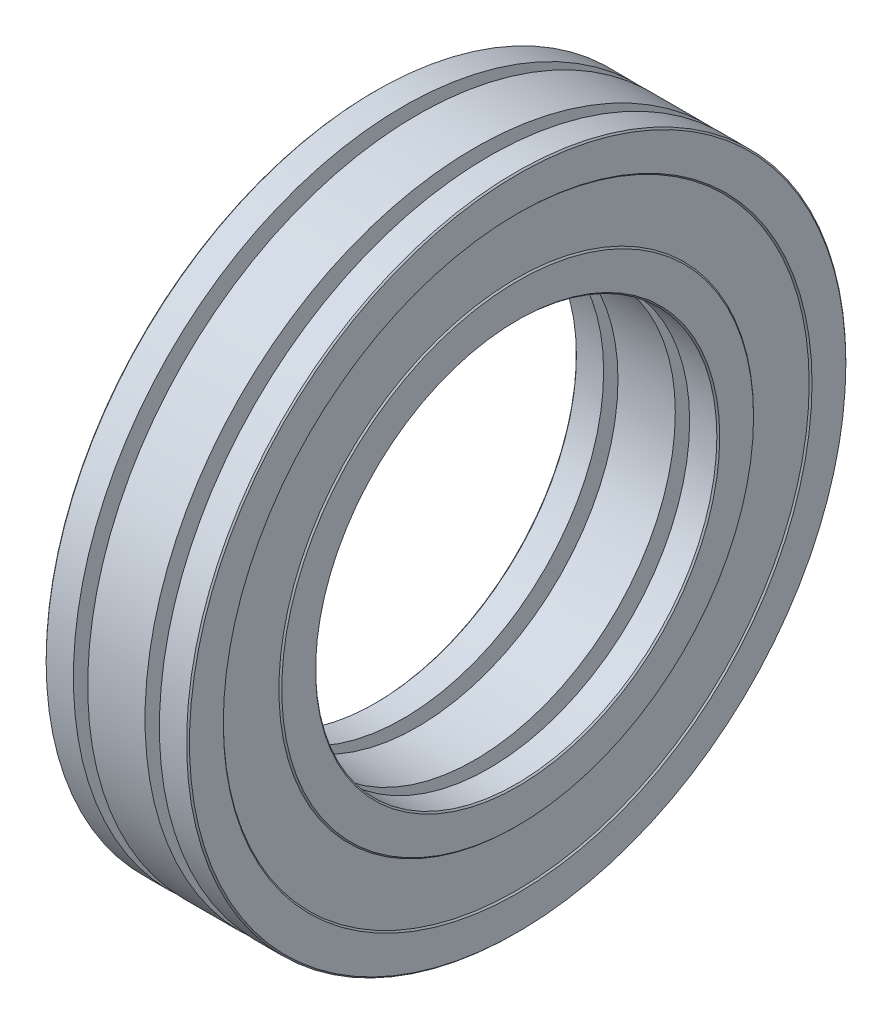
ISO-10303-21;
HEADER;
FILE_DESCRIPTION(('STEP AP214'),'2;1');
FILE_NAME('part.step','',(''),(''),'','','');
FILE_SCHEMA(('AUTOMOTIVE_DESIGN { 1 0 10303 214 1 1 1 1 }'));
ENDSEC;
DATA;
#1=APPLICATION_CONTEXT('core data for automotive mechanical design processes');
#2=APPLICATION_PROTOCOL_DEFINITION('international standard','automotive_design',2000,#1);
#3=PRODUCT_CONTEXT('',#1,'mechanical');
#4=PRODUCT('Part','Part','',(#3));
#5=PRODUCT_RELATED_PRODUCT_CATEGORY('part','',(#4));
#6=PRODUCT_DEFINITION_FORMATION('','',#4);
#7=PRODUCT_DEFINITION_CONTEXT('part definition',#1,'design');
#8=PRODUCT_DEFINITION('design','',#6,#7);
#9=PRODUCT_DEFINITION_SHAPE('','',#8);
#10=(LENGTH_UNIT() NAMED_UNIT(*) SI_UNIT(.MILLI.,.METRE.));
#11=(NAMED_UNIT(*) PLANE_ANGLE_UNIT() SI_UNIT($,.RADIAN.));
#12=(NAMED_UNIT(*) SI_UNIT($,.STERADIAN.) SOLID_ANGLE_UNIT());
#13=UNCERTAINTY_MEASURE_WITH_UNIT(LENGTH_MEASURE(1.E-05),#10,'distance_accuracy_value','');
#14=(GEOMETRIC_REPRESENTATION_CONTEXT(3) GLOBAL_UNCERTAINTY_ASSIGNED_CONTEXT((#13)) GLOBAL_UNIT_ASSIGNED_CONTEXT((#10,
#11,#12)) REPRESENTATION_CONTEXT('',''));
#15=CARTESIAN_POINT('',(0.,0.,0.));
#16=DIRECTION('',(0.,0.,1.));
#17=DIRECTION('',(1.,0.,0.));
#18=AXIS2_PLACEMENT_3D('',#15,#16,#17);
#19=CARTESIAN_POINT('',(0.935183111350298,8.2801724137931,0.));
#20=DIRECTION('',(-1.,0.,0.));
#21=DIRECTION('',(0.,0.,1.));
#22=AXIS2_PLACEMENT_3D('',#19,#20,#21);
#23=PLANE('',#22);
#24=CARTESIAN_POINT('',(0.935183111350298,0.,0.));
#25=DIRECTION('',(-1.,0.,0.));
#26=DIRECTION('',(0.,0.,1.));
#27=AXIS2_PLACEMENT_3D('',#24,#25,#26);
#28=CIRCLE('',#27,8.2301724137931);
#29=CARTESIAN_POINT('',(0.935183111350298,0.,8.2301724137931));
#30=VERTEX_POINT('',#29);
#31=EDGE_CURVE('E83',#30,#30,#28,.T.);
#32=ORIENTED_EDGE('',*,*,#31,.T.);
#33=EDGE_LOOP('',(#32));
#34=FACE_BOUND('',#33,.T.);
#35=CARTESIAN_POINT('',(0.935183111350298,0.,0.));
#36=DIRECTION('',(-1.,0.,0.));
#37=DIRECTION('',(0.,0.,1.));
#38=AXIS2_PLACEMENT_3D('',#35,#36,#37);
#39=CIRCLE('',#38,7.05);
#40=CARTESIAN_POINT('',(0.935183111350298,0.,7.05));
#41=VERTEX_POINT('',#40);
#42=EDGE_CURVE('E86',#41,#41,#39,.F.);
#43=ORIENTED_EDGE('',*,*,#42,.T.);
#44=EDGE_LOOP('',(#43));
#45=FACE_BOUND('',#44,.T.);
#46=ADVANCED_FACE('F45',(#34,#45),#23,.T.);
#47=CARTESIAN_POINT('',(0.,0.,0.));
#48=DIRECTION('',(1.,0.,0.));
#49=DIRECTION('',(0.,0.,-1.));
#50=AXIS2_PLACEMENT_3D('',#47,#48,#49);
#51=CYLINDRICAL_SURFACE('',#50,7.);
#52=CARTESIAN_POINT('',(0.985183111350298,0.,0.));
#53=DIRECTION('',(-1.,0.,0.));
#54=DIRECTION('',(0.,0.,1.));
#55=AXIS2_PLACEMENT_3D('',#52,#53,#54);
#56=CIRCLE('',#55,7.);
#57=CARTESIAN_POINT('',(0.985183111350298,0.,7.));
#58=VERTEX_POINT('',#57);
#59=EDGE_CURVE('E80',#58,#58,#56,.T.);
#60=ORIENTED_EDGE('',*,*,#59,.T.);
#61=EDGE_LOOP('',(#60));
#62=FACE_BOUND('',#61,.T.);
#63=CARTESIAN_POINT('',(1.9351831113503,0.,0.));
#64=DIRECTION('',(1.,0.,0.));
#65=DIRECTION('',(0.,0.,-1.));
#66=AXIS2_PLACEMENT_3D('',#63,#64,#65);
#67=CIRCLE('',#66,7.);
#68=CARTESIAN_POINT('',(1.9351831113503,0.,-7.));
#69=VERTEX_POINT('',#68);
#70=EDGE_CURVE('E89',#69,#69,#67,.T.);
#71=ORIENTED_EDGE('',*,*,#70,.T.);
#72=EDGE_LOOP('',(#71));
#73=FACE_BOUND('',#72,.T.);
#74=ADVANCED_FACE('F170',(#62,#73),#51,.F.);
#75=CARTESIAN_POINT('',(1.9351831113503,7.,0.));
#76=DIRECTION('',(1.,0.,0.));
#77=DIRECTION('',(0.,0.,-1.));
#78=AXIS2_PLACEMENT_3D('',#75,#76,#77);
#79=PLANE('',#78);
#80=CARTESIAN_POINT('',(1.9351831113503,0.,0.));
#81=DIRECTION('',(1.,0.,0.));
#82=DIRECTION('',(0.,0.,-1.));
#83=AXIS2_PLACEMENT_3D('',#80,#81,#82);
#84=CIRCLE('',#83,7.8);
#85=CARTESIAN_POINT('',(1.9351831113503,0.,-7.8));
#86=VERTEX_POINT('',#85);
#87=EDGE_CURVE('E92',#86,#86,#84,.T.);
#88=ORIENTED_EDGE('',*,*,#87,.T.);
#89=EDGE_LOOP('',(#88));
#90=FACE_BOUND('',#89,.T.);
#91=ORIENTED_EDGE('',*,*,#70,.F.);
#92=EDGE_LOOP('',(#91));
#93=FACE_BOUND('',#92,.T.);
#94=ADVANCED_FACE('F175',(#90,#93),#79,.T.);
#95=CARTESIAN_POINT('',(0.,0.,0.));
#96=DIRECTION('',(1.,0.,0.));
#97=DIRECTION('',(0.,0.,-1.));
#98=AXIS2_PLACEMENT_3D('',#95,#96,#97);
#99=CYLINDRICAL_SURFACE('',#98,7.8);
#100=CARTESIAN_POINT('',(2.4351831113503,0.,0.));
#101=DIRECTION('',(1.,0.,0.));
#102=DIRECTION('',(0.,0.,-1.));
#103=AXIS2_PLACEMENT_3D('',#100,#101,#102);
#104=CIRCLE('',#103,7.8);
#105=CARTESIAN_POINT('',(2.4351831113503,0.,-7.8));
#106=VERTEX_POINT('',#105);
#107=EDGE_CURVE('E95',#106,#106,#104,.T.);
#108=ORIENTED_EDGE('',*,*,#107,.T.);
#109=EDGE_LOOP('',(#108));
#110=FACE_BOUND('',#109,.T.);
#111=ORIENTED_EDGE('',*,*,#87,.F.);
#112=EDGE_LOOP('',(#111));
#113=FACE_BOUND('',#112,.T.);
#114=ADVANCED_FACE('F182',(#110,#113),#99,.F.);
#115=CARTESIAN_POINT('',(2.4351831113503,7.8,0.));
#116=DIRECTION('',(-1.,0.,0.));
#117=DIRECTION('',(0.,0.,1.));
#118=AXIS2_PLACEMENT_3D('',#115,#116,#117);
#119=PLANE('',#118);
#120=CARTESIAN_POINT('',(2.4351831113503,0.,0.));
#121=DIRECTION('',(1.,0.,0.));
#122=DIRECTION('',(0.,0.,-1.));
#123=AXIS2_PLACEMENT_3D('',#120,#121,#122);
#124=CIRCLE('',#123,7.);
#125=CARTESIAN_POINT('',(2.4351831113503,0.,-7.));
#126=VERTEX_POINT('',#125);
#127=EDGE_CURVE('E98',#126,#126,#124,.T.);
#128=ORIENTED_EDGE('',*,*,#127,.T.);
#129=EDGE_LOOP('',(#128));
#130=FACE_BOUND('',#129,.T.);
#131=ORIENTED_EDGE('',*,*,#107,.F.);
#132=EDGE_LOOP('',(#131));
#133=FACE_BOUND('',#132,.T.);
#134=ADVANCED_FACE('F186',(#130,#133),#119,.T.);
#135=CARTESIAN_POINT('',(0.,0.,0.));
#136=DIRECTION('',(1.,0.,0.));
#137=DIRECTION('',(0.,0.,-1.));
#138=AXIS2_PLACEMENT_3D('',#135,#136,#137);
#139=CYLINDRICAL_SURFACE('',#138,7.);
#140=CARTESIAN_POINT('',(4.4351831113503,0.,0.));
#141=DIRECTION('',(1.,0.,0.));
#142=DIRECTION('',(0.,0.,-1.));
#143=AXIS2_PLACEMENT_3D('',#140,#141,#142);
#144=CIRCLE('',#143,7.);
#145=CARTESIAN_POINT('',(4.4351831113503,0.,-7.));
#146=VERTEX_POINT('',#145);
#147=EDGE_CURVE('E101',#146,#146,#144,.T.);
#148=ORIENTED_EDGE('',*,*,#147,.T.);
#149=EDGE_LOOP('',(#148));
#150=FACE_BOUND('',#149,.T.);
#151=ORIENTED_EDGE('',*,*,#127,.F.);
#152=EDGE_LOOP('',(#151));
#153=FACE_BOUND('',#152,.T.);
#154=ADVANCED_FACE('F190',(#150,#153),#139,.F.);
#155=CARTESIAN_POINT('',(4.4351831113503,7.,0.));
#156=DIRECTION('',(1.,0.,0.));
#157=DIRECTION('',(0.,0.,-1.));
#158=AXIS2_PLACEMENT_3D('',#155,#156,#157);
#159=PLANE('',#158);
#160=CARTESIAN_POINT('',(4.4351831113503,0.,0.));
#161=DIRECTION('',(1.,0.,0.));
#162=DIRECTION('',(0.,0.,-1.));
#163=AXIS2_PLACEMENT_3D('',#160,#161,#162);
#164=CIRCLE('',#163,7.8);
#165=CARTESIAN_POINT('',(4.4351831113503,0.,-7.8));
#166=VERTEX_POINT('',#165);
#167=EDGE_CURVE('E104',#166,#166,#164,.T.);
#168=ORIENTED_EDGE('',*,*,#167,.T.);
#169=EDGE_LOOP('',(#168));
#170=FACE_BOUND('',#169,.T.);
#171=ORIENTED_EDGE('',*,*,#147,.F.);
#172=EDGE_LOOP('',(#171));
#173=FACE_BOUND('',#172,.T.);
#174=ADVANCED_FACE('F194',(#170,#173),#159,.T.);
#175=CARTESIAN_POINT('',(0.,0.,0.));
#176=DIRECTION('',(1.,0.,0.));
#177=DIRECTION('',(0.,0.,-1.));
#178=AXIS2_PLACEMENT_3D('',#175,#176,#177);
#179=CYLINDRICAL_SURFACE('',#178,7.8);
#180=CARTESIAN_POINT('',(4.9351831113503,0.,0.));
#181=DIRECTION('',(1.,0.,0.));
#182=DIRECTION('',(0.,0.,-1.));
#183=AXIS2_PLACEMENT_3D('',#180,#181,#182);
#184=CIRCLE('',#183,7.8);
#185=CARTESIAN_POINT('',(4.9351831113503,0.,-7.8));
#186=VERTEX_POINT('',#185);
#187=EDGE_CURVE('E107',#186,#186,#184,.T.);
#188=ORIENTED_EDGE('',*,*,#187,.T.);
#189=EDGE_LOOP('',(#188));
#190=FACE_BOUND('',#189,.T.);
#191=ORIENTED_EDGE('',*,*,#167,.F.);
#192=EDGE_LOOP('',(#191));
#193=FACE_BOUND('',#192,.T.);
#194=ADVANCED_FACE('F198',(#190,#193),#179,.F.);
#195=CARTESIAN_POINT('',(4.9351831113503,7.8,0.));
#196=DIRECTION('',(-1.,0.,0.));
#197=DIRECTION('',(0.,0.,1.));
#198=AXIS2_PLACEMENT_3D('',#195,#196,#197);
#199=PLANE('',#198);
#200=CARTESIAN_POINT('',(4.9351831113503,0.,0.));
#201=DIRECTION('',(1.,0.,0.));
#202=DIRECTION('',(0.,0.,-1.));
#203=AXIS2_PLACEMENT_3D('',#200,#201,#202);
#204=CIRCLE('',#203,7.);
#205=CARTESIAN_POINT('',(4.9351831113503,0.,-7.));
#206=VERTEX_POINT('',#205);
#207=EDGE_CURVE('E110',#206,#206,#204,.T.);
#208=ORIENTED_EDGE('',*,*,#207,.T.);
#209=EDGE_LOOP('',(#208));
#210=FACE_BOUND('',#209,.T.);
#211=ORIENTED_EDGE('',*,*,#187,.F.);
#212=EDGE_LOOP('',(#211));
#213=FACE_BOUND('',#212,.T.);
#214=ADVANCED_FACE('F202',(#210,#213),#199,.T.);
#215=CARTESIAN_POINT('',(0.,0.,0.));
#216=DIRECTION('',(1.,0.,0.));
#217=DIRECTION('',(0.,0.,-1.));
#218=AXIS2_PLACEMENT_3D('',#215,#216,#217);
#219=CYLINDRICAL_SURFACE('',#218,7.);
#220=CARTESIAN_POINT('',(5.8851831113503,0.,0.));
#221=DIRECTION('',(1.,0.,0.));
#222=DIRECTION('',(0.,0.,-1.));
#223=AXIS2_PLACEMENT_3D('',#220,#221,#222);
#224=CIRCLE('',#223,7.);
#225=CARTESIAN_POINT('',(5.8851831113503,0.,-7.));
#226=VERTEX_POINT('',#225);
#227=EDGE_CURVE('E68',#226,#226,#224,.T.);
#228=ORIENTED_EDGE('',*,*,#227,.T.);
#229=EDGE_LOOP('',(#228));
#230=FACE_BOUND('',#229,.T.);
#231=ORIENTED_EDGE('',*,*,#207,.F.);
#232=EDGE_LOOP('',(#231));
#233=FACE_BOUND('',#232,.T.);
#234=ADVANCED_FACE('F206',(#230,#233),#219,.F.);
#235=CARTESIAN_POINT('',(5.9351831113503,7.,0.));
#236=DIRECTION('',(1.,0.,0.));
#237=DIRECTION('',(0.,0.,-1.));
#238=AXIS2_PLACEMENT_3D('',#235,#236,#237);
#239=PLANE('',#238);
#240=CARTESIAN_POINT('',(5.9351831113503,0.,0.));
#241=DIRECTION('',(1.,0.,0.));
#242=DIRECTION('',(0.,0.,-1.));
#243=AXIS2_PLACEMENT_3D('',#240,#241,#242);
#244=CIRCLE('',#243,7.05);
#245=CARTESIAN_POINT('',(5.9351831113503,0.,-7.05));
#246=VERTEX_POINT('',#245);
#247=EDGE_CURVE('E60',#246,#246,#244,.F.);
#248=ORIENTED_EDGE('',*,*,#247,.T.);
#249=EDGE_LOOP('',(#248));
#250=FACE_BOUND('',#249,.T.);
#251=CARTESIAN_POINT('',(5.9351831113503,0.,0.));
#252=DIRECTION('',(1.,0.,0.));
#253=DIRECTION('',(0.,0.,-1.));
#254=AXIS2_PLACEMENT_3D('',#251,#252,#253);
#255=CIRCLE('',#254,8.2301724137931);
#256=CARTESIAN_POINT('',(5.9351831113503,0.,-8.2301724137931));
#257=VERTEX_POINT('',#256);
#258=EDGE_CURVE('E65',#257,#257,#255,.T.);
#259=ORIENTED_EDGE('',*,*,#258,.T.);
#260=EDGE_LOOP('',(#259));
#261=FACE_BOUND('',#260,.T.);
#262=ADVANCED_FACE('F210',(#250,#261),#239,.T.);
#263=CARTESIAN_POINT('',(5.8851831113503,8.2801724137931,0.));
#264=DIRECTION('',(1.,0.,0.));
#265=DIRECTION('',(0.,0.,-1.));
#266=AXIS2_PLACEMENT_3D('',#263,#264,#265);
#267=PLANE('',#266);
#268=CARTESIAN_POINT('',(5.8851831113503,0.,0.));
#269=DIRECTION('',(1.,0.,0.));
#270=DIRECTION('',(0.,0.,-1.));
#271=AXIS2_PLACEMENT_3D('',#268,#269,#270);
#272=CIRCLE('',#271,10.2198275862069);
#273=CARTESIAN_POINT('',(5.8851831113503,0.,-10.2198275862069));
#274=VERTEX_POINT('',#273);
#275=EDGE_CURVE('E116',#274,#274,#272,.T.);
#276=ORIENTED_EDGE('',*,*,#275,.T.);
#277=EDGE_LOOP('',(#276));
#278=FACE_BOUND('',#277,.T.);
#279=CARTESIAN_POINT('',(5.8851831113503,0.,0.));
#280=DIRECTION('',(1.,0.,0.));
#281=DIRECTION('',(0.,0.,-1.));
#282=AXIS2_PLACEMENT_3D('',#279,#280,#281);
#283=CIRCLE('',#282,8.2801724137931);
#284=CARTESIAN_POINT('',(5.8851831113503,0.,-8.2801724137931));
#285=VERTEX_POINT('',#284);
#286=EDGE_CURVE('E113',#285,#285,#283,.T.);
#287=ORIENTED_EDGE('',*,*,#286,.F.);
#288=EDGE_LOOP('',(#287));
#289=FACE_BOUND('',#288,.T.);
#290=ADVANCED_FACE('F214',(#278,#289),#267,.T.);
#291=CARTESIAN_POINT('',(5.9351831113503,10.2198275862069,0.));
#292=DIRECTION('',(1.,0.,0.));
#293=DIRECTION('',(0.,0.,-1.));
#294=AXIS2_PLACEMENT_3D('',#291,#292,#293);
#295=PLANE('',#294);
#296=CARTESIAN_POINT('',(5.9351831113503,0.,0.));
#297=DIRECTION('',(1.,0.,0.));
#298=DIRECTION('',(0.,0.,-1.));
#299=AXIS2_PLACEMENT_3D('',#296,#297,#298);
#300=CIRCLE('',#299,10.2698275862069);
#301=CARTESIAN_POINT('',(5.9351831113503,0.,-10.2698275862069));
#302=VERTEX_POINT('',#301);
#303=EDGE_CURVE('E52',#302,#302,#300,.F.);
#304=ORIENTED_EDGE('',*,*,#303,.T.);
#305=EDGE_LOOP('',(#304));
#306=FACE_BOUND('',#305,.T.);
#307=CARTESIAN_POINT('',(5.9351831113503,0.,0.));
#308=DIRECTION('',(1.,0.,0.));
#309=DIRECTION('',(0.,0.,-1.));
#310=AXIS2_PLACEMENT_3D('',#307,#308,#309);
#311=CIRCLE('',#310,11.45);
#312=CARTESIAN_POINT('',(5.9351831113503,0.,-11.45));
#313=VERTEX_POINT('',#312);
#314=EDGE_CURVE('E56',#313,#313,#311,.T.);
#315=ORIENTED_EDGE('',*,*,#314,.T.);
#316=EDGE_LOOP('',(#315));
#317=FACE_BOUND('',#316,.T.);
#318=ADVANCED_FACE('F218',(#306,#317),#295,.T.);
#319=CARTESIAN_POINT('',(0.,0.,0.));
#320=DIRECTION('',(1.,0.,0.));
#321=DIRECTION('',(0.,0.,-1.));
#322=AXIS2_PLACEMENT_3D('',#319,#320,#321);
#323=CYLINDRICAL_SURFACE('',#322,11.5);
#324=CARTESIAN_POINT('',(5.8851831113503,0.,0.));
#325=DIRECTION('',(1.,0.,0.));
#326=DIRECTION('',(0.,0.,-1.));
#327=AXIS2_PLACEMENT_3D('',#324,#325,#326);
#328=CIRCLE('',#327,11.5);
#329=CARTESIAN_POINT('',(5.8851831113503,0.,-11.5));
#330=VERTEX_POINT('',#329);
#331=EDGE_CURVE('E12',#330,#330,#328,.F.);
#332=ORIENTED_EDGE('',*,*,#331,.T.);
#333=EDGE_LOOP('',(#332));
#334=FACE_BOUND('',#333,.T.);
#335=CARTESIAN_POINT('',(4.9351831113503,0.,0.));
#336=DIRECTION('',(1.,0.,0.));
#337=DIRECTION('',(0.,0.,-1.));
#338=AXIS2_PLACEMENT_3D('',#335,#336,#337);
#339=CIRCLE('',#338,11.5);
#340=CARTESIAN_POINT('',(4.9351831113503,0.,-11.5));
#341=VERTEX_POINT('',#340);
#342=EDGE_CURVE('E119',#341,#341,#339,.T.);
#343=ORIENTED_EDGE('',*,*,#342,.T.);
#344=EDGE_LOOP('',(#343));
#345=FACE_BOUND('',#344,.T.);
#346=ADVANCED_FACE('F222',(#334,#345),#323,.T.);
#347=CARTESIAN_POINT('',(4.9351831113503,10.7,0.));
#348=DIRECTION('',(-1.,0.,0.));
#349=DIRECTION('',(0.,0.,1.));
#350=AXIS2_PLACEMENT_3D('',#347,#348,#349);
#351=PLANE('',#350);
#352=CARTESIAN_POINT('',(4.9351831113503,0.,0.));
#353=DIRECTION('',(1.,0.,0.));
#354=DIRECTION('',(0.,0.,-1.));
#355=AXIS2_PLACEMENT_3D('',#352,#353,#354);
#356=CIRCLE('',#355,10.7);
#357=CARTESIAN_POINT('',(4.9351831113503,0.,-10.7));
#358=VERTEX_POINT('',#357);
#359=EDGE_CURVE('E122',#358,#358,#356,.T.);
#360=ORIENTED_EDGE('',*,*,#359,.T.);
#361=EDGE_LOOP('',(#360));
#362=FACE_BOUND('',#361,.T.);
#363=ORIENTED_EDGE('',*,*,#342,.F.);
#364=EDGE_LOOP('',(#363));
#365=FACE_BOUND('',#364,.T.);
#366=ADVANCED_FACE('F225',(#362,#365),#351,.T.);
#367=CARTESIAN_POINT('',(0.,0.,0.));
#368=DIRECTION('',(1.,0.,0.));
#369=DIRECTION('',(0.,0.,-1.));
#370=AXIS2_PLACEMENT_3D('',#367,#368,#369);
#371=CYLINDRICAL_SURFACE('',#370,10.7);
#372=CARTESIAN_POINT('',(4.4351831113503,0.,0.));
#373=DIRECTION('',(1.,0.,0.));
#374=DIRECTION('',(0.,0.,-1.));
#375=AXIS2_PLACEMENT_3D('',#372,#373,#374);
#376=CIRCLE('',#375,10.7);
#377=CARTESIAN_POINT('',(4.4351831113503,0.,-10.7));
#378=VERTEX_POINT('',#377);
#379=EDGE_CURVE('E125',#378,#378,#376,.T.);
#380=ORIENTED_EDGE('',*,*,#379,.T.);
#381=EDGE_LOOP('',(#380));
#382=FACE_BOUND('',#381,.T.);
#383=ORIENTED_EDGE('',*,*,#359,.F.);
#384=EDGE_LOOP('',(#383));
#385=FACE_BOUND('',#384,.T.);
#386=ADVANCED_FACE('F228',(#382,#385),#371,.T.);
#387=CARTESIAN_POINT('',(4.4351831113503,11.5,0.));
#388=DIRECTION('',(1.,0.,0.));
#389=DIRECTION('',(0.,0.,-1.));
#390=AXIS2_PLACEMENT_3D('',#387,#388,#389);
#391=PLANE('',#390);
#392=CARTESIAN_POINT('',(4.4351831113503,0.,0.));
#393=DIRECTION('',(1.,0.,0.));
#394=DIRECTION('',(0.,0.,-1.));
#395=AXIS2_PLACEMENT_3D('',#392,#393,#394);
#396=CIRCLE('',#395,11.5);
#397=CARTESIAN_POINT('',(4.4351831113503,0.,-11.5));
#398=VERTEX_POINT('',#397);
#399=EDGE_CURVE('E128',#398,#398,#396,.T.);
#400=ORIENTED_EDGE('',*,*,#399,.T.);
#401=EDGE_LOOP('',(#400));
#402=FACE_BOUND('',#401,.T.);
#403=ORIENTED_EDGE('',*,*,#379,.F.);
#404=EDGE_LOOP('',(#403));
#405=FACE_BOUND('',#404,.T.);
#406=ADVANCED_FACE('F232',(#402,#405),#391,.T.);
#407=CARTESIAN_POINT('',(0.,0.,0.));
#408=DIRECTION('',(1.,0.,0.));
#409=DIRECTION('',(0.,0.,-1.));
#410=AXIS2_PLACEMENT_3D('',#407,#408,#409);
#411=CYLINDRICAL_SURFACE('',#410,11.5);
#412=CARTESIAN_POINT('',(2.4351831113503,0.,0.));
#413=DIRECTION('',(1.,0.,0.));
#414=DIRECTION('',(0.,0.,-1.));
#415=AXIS2_PLACEMENT_3D('',#412,#413,#414);
#416=CIRCLE('',#415,11.5);
#417=CARTESIAN_POINT('',(2.4351831113503,0.,-11.5));
#418=VERTEX_POINT('',#417);
#419=EDGE_CURVE('E131',#418,#418,#416,.T.);
#420=ORIENTED_EDGE('',*,*,#419,.T.);
#421=EDGE_LOOP('',(#420));
#422=FACE_BOUND('',#421,.T.);
#423=ORIENTED_EDGE('',*,*,#399,.F.);
#424=EDGE_LOOP('',(#423));
#425=FACE_BOUND('',#424,.T.);
#426=ADVANCED_FACE('F236',(#422,#425),#411,.T.);
#427=CARTESIAN_POINT('',(2.4351831113503,10.7,0.));
#428=DIRECTION('',(-1.,0.,0.));
#429=DIRECTION('',(0.,0.,1.));
#430=AXIS2_PLACEMENT_3D('',#427,#428,#429);
#431=PLANE('',#430);
#432=CARTESIAN_POINT('',(2.4351831113503,0.,0.));
#433=DIRECTION('',(1.,0.,0.));
#434=DIRECTION('',(0.,0.,-1.));
#435=AXIS2_PLACEMENT_3D('',#432,#433,#434);
#436=CIRCLE('',#435,10.7);
#437=CARTESIAN_POINT('',(2.4351831113503,0.,-10.7));
#438=VERTEX_POINT('',#437);
#439=EDGE_CURVE('E134',#438,#438,#436,.T.);
#440=ORIENTED_EDGE('',*,*,#439,.T.);
#441=EDGE_LOOP('',(#440));
#442=FACE_BOUND('',#441,.T.);
#443=ORIENTED_EDGE('',*,*,#419,.F.);
#444=EDGE_LOOP('',(#443));
#445=FACE_BOUND('',#444,.T.);
#446=ADVANCED_FACE('F240',(#442,#445),#431,.T.);
#447=CARTESIAN_POINT('',(0.,0.,0.));
#448=DIRECTION('',(1.,0.,0.));
#449=DIRECTION('',(0.,0.,-1.));
#450=AXIS2_PLACEMENT_3D('',#447,#448,#449);
#451=CYLINDRICAL_SURFACE('',#450,10.7);
#452=CARTESIAN_POINT('',(1.9351831113503,0.,0.));
#453=DIRECTION('',(1.,0.,0.));
#454=DIRECTION('',(0.,0.,-1.));
#455=AXIS2_PLACEMENT_3D('',#452,#453,#454);
#456=CIRCLE('',#455,10.7);
#457=CARTESIAN_POINT('',(1.9351831113503,0.,-10.7));
#458=VERTEX_POINT('',#457);
#459=EDGE_CURVE('E137',#458,#458,#456,.T.);
#460=ORIENTED_EDGE('',*,*,#459,.T.);
#461=EDGE_LOOP('',(#460));
#462=FACE_BOUND('',#461,.T.);
#463=ORIENTED_EDGE('',*,*,#439,.F.);
#464=EDGE_LOOP('',(#463));
#465=FACE_BOUND('',#464,.T.);
#466=ADVANCED_FACE('F244',(#462,#465),#451,.T.);
#467=CARTESIAN_POINT('',(1.9351831113503,11.5,0.));
#468=DIRECTION('',(1.,0.,0.));
#469=DIRECTION('',(0.,0.,-1.));
#470=AXIS2_PLACEMENT_3D('',#467,#468,#469);
#471=PLANE('',#470);
#472=CARTESIAN_POINT('',(1.9351831113503,0.,0.));
#473=DIRECTION('',(1.,0.,0.));
#474=DIRECTION('',(0.,0.,-1.));
#475=AXIS2_PLACEMENT_3D('',#472,#473,#474);
#476=CIRCLE('',#475,11.5);
#477=CARTESIAN_POINT('',(1.9351831113503,0.,-11.5));
#478=VERTEX_POINT('',#477);
#479=EDGE_CURVE('E140',#478,#478,#476,.T.);
#480=ORIENTED_EDGE('',*,*,#479,.T.);
#481=EDGE_LOOP('',(#480));
#482=FACE_BOUND('',#481,.T.);
#483=ORIENTED_EDGE('',*,*,#459,.F.);
#484=EDGE_LOOP('',(#483));
#485=FACE_BOUND('',#484,.T.);
#486=ADVANCED_FACE('F248',(#482,#485),#471,.T.);
#487=CARTESIAN_POINT('',(0.,0.,0.));
#488=DIRECTION('',(1.,0.,0.));
#489=DIRECTION('',(0.,0.,-1.));
#490=AXIS2_PLACEMENT_3D('',#487,#488,#489);
#491=CYLINDRICAL_SURFACE('',#490,11.5);
#492=CARTESIAN_POINT('',(0.985183111350301,0.,0.));
#493=DIRECTION('',(-1.,0.,0.));
#494=DIRECTION('',(0.,0.,1.));
#495=AXIS2_PLACEMENT_3D('',#492,#493,#494);
#496=CIRCLE('',#495,11.5);
#497=CARTESIAN_POINT('',(0.985183111350301,0.,11.5));
#498=VERTEX_POINT('',#497);
#499=EDGE_CURVE('E77',#498,#498,#496,.F.);
#500=ORIENTED_EDGE('',*,*,#499,.T.);
#501=EDGE_LOOP('',(#500));
#502=FACE_BOUND('',#501,.T.);
#503=ORIENTED_EDGE('',*,*,#479,.F.);
#504=EDGE_LOOP('',(#503));
#505=FACE_BOUND('',#504,.T.);
#506=ADVANCED_FACE('F252',(#502,#505),#491,.T.);
#507=CARTESIAN_POINT('',(0.935183111350298,11.5,0.));
#508=DIRECTION('',(-1.,0.,0.));
#509=DIRECTION('',(0.,0.,1.));
#510=AXIS2_PLACEMENT_3D('',#507,#508,#509);
#511=PLANE('',#510);
#512=CARTESIAN_POINT('',(0.935183111350298,0.,0.));
#513=DIRECTION('',(-1.,0.,0.));
#514=DIRECTION('',(0.,0.,1.));
#515=AXIS2_PLACEMENT_3D('',#512,#513,#514);
#516=CIRCLE('',#515,11.45);
#517=CARTESIAN_POINT('',(0.935183111350298,0.,11.45));
#518=VERTEX_POINT('',#517);
#519=EDGE_CURVE('E71',#518,#518,#516,.T.);
#520=ORIENTED_EDGE('',*,*,#519,.T.);
#521=EDGE_LOOP('',(#520));
#522=FACE_BOUND('',#521,.T.);
#523=CARTESIAN_POINT('',(0.935183111350298,0.,0.));
#524=DIRECTION('',(-1.,0.,0.));
#525=DIRECTION('',(0.,0.,1.));
#526=AXIS2_PLACEMENT_3D('',#523,#524,#525);
#527=CIRCLE('',#526,10.2698275862069);
#528=CARTESIAN_POINT('',(0.935183111350298,0.,10.2698275862069));
#529=VERTEX_POINT('',#528);
#530=EDGE_CURVE('E74',#529,#529,#527,.F.);
#531=ORIENTED_EDGE('',*,*,#530,.T.);
#532=EDGE_LOOP('',(#531));
#533=FACE_BOUND('',#532,.T.);
#534=ADVANCED_FACE('F165',(#522,#533),#511,.T.);
#535=CARTESIAN_POINT('',(0.985183111350298,10.2198275862069,0.));
#536=DIRECTION('',(-1.,0.,0.));
#537=DIRECTION('',(0.,0.,1.));
#538=AXIS2_PLACEMENT_3D('',#535,#536,#537);
#539=PLANE('',#538);
#540=CARTESIAN_POINT('',(0.985183111350298,0.,0.));
#541=DIRECTION('',(1.,0.,0.));
#542=DIRECTION('',(0.,0.,-1.));
#543=AXIS2_PLACEMENT_3D('',#540,#541,#542);
#544=CIRCLE('',#543,8.2801724137931);
#545=CARTESIAN_POINT('',(0.985183111350298,0.,-8.2801724137931));
#546=VERTEX_POINT('',#545);
#547=EDGE_CURVE('E146',#546,#546,#544,.T.);
#548=ORIENTED_EDGE('',*,*,#547,.T.);
#549=EDGE_LOOP('',(#548));
#550=FACE_BOUND('',#549,.T.);
#551=CARTESIAN_POINT('',(0.985183111350298,0.,0.));
#552=DIRECTION('',(1.,0.,0.));
#553=DIRECTION('',(0.,0.,-1.));
#554=AXIS2_PLACEMENT_3D('',#551,#552,#553);
#555=CIRCLE('',#554,10.2198275862069);
#556=CARTESIAN_POINT('',(0.985183111350298,0.,-10.2198275862069));
#557=VERTEX_POINT('',#556);
#558=EDGE_CURVE('E143',#557,#557,#555,.T.);
#559=ORIENTED_EDGE('',*,*,#558,.F.);
#560=EDGE_LOOP('',(#559));
#561=FACE_BOUND('',#560,.T.);
#562=ADVANCED_FACE('F150',(#550,#561),#539,.T.);
#563=CARTESIAN_POINT('',(0.985183111350299,0.,0.));
#564=DIRECTION('',(1.,0.,0.));
#565=DIRECTION('',(0.,0.,-1.));
#566=AXIS2_PLACEMENT_3D('',#563,#564,#565);
#567=CONICAL_SURFACE('',#566,8.2801724137931,0.785398163397448);
#568=ORIENTED_EDGE('',*,*,#31,.F.);
#569=EDGE_LOOP('',(#568));
#570=FACE_BOUND('',#569,.T.);
#571=ORIENTED_EDGE('',*,*,#547,.F.);
#572=EDGE_LOOP('',(#571));
#573=FACE_BOUND('',#572,.T.);
#574=ADVANCED_FACE('F153',(#570,#573),#567,.T.);
#575=CARTESIAN_POINT('',(0.935183111350298,0.,0.));
#576=DIRECTION('',(-1.,0.,0.));
#577=DIRECTION('',(0.,0.,1.));
#578=AXIS2_PLACEMENT_3D('',#575,#576,#577);
#579=CONICAL_SURFACE('',#578,7.05,0.785398163397483);
#580=ORIENTED_EDGE('',*,*,#59,.F.);
#581=EDGE_LOOP('',(#580));
#582=FACE_BOUND('',#581,.T.);
#583=ORIENTED_EDGE('',*,*,#42,.F.);
#584=EDGE_LOOP('',(#583));
#585=FACE_BOUND('',#584,.T.);
#586=ADVANCED_FACE('F155',(#582,#585),#579,.F.);
#587=CARTESIAN_POINT('',(0.985183111350301,0.,0.));
#588=DIRECTION('',(1.,0.,0.));
#589=DIRECTION('',(0.,0.,-1.));
#590=AXIS2_PLACEMENT_3D('',#587,#588,#589);
#591=CONICAL_SURFACE('',#590,11.5,0.785398163397431);
#592=ORIENTED_EDGE('',*,*,#519,.F.);
#593=EDGE_LOOP('',(#592));
#594=FACE_BOUND('',#593,.T.);
#595=ORIENTED_EDGE('',*,*,#499,.F.);
#596=EDGE_LOOP('',(#595));
#597=FACE_BOUND('',#596,.T.);
#598=ADVANCED_FACE('F162',(#594,#597),#591,.T.);
#599=CARTESIAN_POINT('',(0.935183111350298,0.,0.));
#600=DIRECTION('',(-1.,0.,0.));
#601=DIRECTION('',(0.,0.,1.));
#602=AXIS2_PLACEMENT_3D('',#599,#600,#601);
#603=CONICAL_SURFACE('',#602,10.2698275862069,0.785398163397483);
#604=ORIENTED_EDGE('',*,*,#558,.T.);
#605=EDGE_LOOP('',(#604));
#606=FACE_BOUND('',#605,.T.);
#607=ORIENTED_EDGE('',*,*,#530,.F.);
#608=EDGE_LOOP('',(#607));
#609=FACE_BOUND('',#608,.T.);
#610=ADVANCED_FACE('F265',(#606,#609),#603,.F.);
#611=CARTESIAN_POINT('',(5.8851831113503,0.,0.));
#612=DIRECTION('',(1.,0.,0.));
#613=DIRECTION('',(0.,0.,-1.));
#614=AXIS2_PLACEMENT_3D('',#611,#612,#613);
#615=CONICAL_SURFACE('',#614,7.,0.78539816339744);
#616=ORIENTED_EDGE('',*,*,#247,.F.);
#617=EDGE_LOOP('',(#616));
#618=FACE_BOUND('',#617,.T.);
#619=ORIENTED_EDGE('',*,*,#227,.F.);
#620=EDGE_LOOP('',(#619));
#621=FACE_BOUND('',#620,.T.);
#622=ADVANCED_FACE('F267',(#618,#621),#615,.F.);
#623=CARTESIAN_POINT('',(5.9351831113503,0.,0.));
#624=DIRECTION('',(-1.,0.,0.));
#625=DIRECTION('',(0.,0.,1.));
#626=AXIS2_PLACEMENT_3D('',#623,#624,#625);
#627=CONICAL_SURFACE('',#626,8.2301724137931,0.785398163397414);
#628=ORIENTED_EDGE('',*,*,#286,.T.);
#629=EDGE_LOOP('',(#628));
#630=FACE_BOUND('',#629,.T.);
#631=ORIENTED_EDGE('',*,*,#258,.F.);
#632=EDGE_LOOP('',(#631));
#633=FACE_BOUND('',#632,.T.);
#634=ADVANCED_FACE('F274',(#630,#633),#627,.T.);
#635=CARTESIAN_POINT('',(5.88518311135031,0.,0.));
#636=DIRECTION('',(1.,0.,0.));
#637=DIRECTION('',(0.,0.,-1.));
#638=AXIS2_PLACEMENT_3D('',#635,#636,#637);
#639=CONICAL_SURFACE('',#638,10.2198275862069,0.785398163397431);
#640=ORIENTED_EDGE('',*,*,#303,.F.);
#641=EDGE_LOOP('',(#640));
#642=FACE_BOUND('',#641,.T.);
#643=ORIENTED_EDGE('',*,*,#275,.F.);
#644=EDGE_LOOP('',(#643));
#645=FACE_BOUND('',#644,.T.);
#646=ADVANCED_FACE('F281',(#642,#645),#639,.F.);
#647=CARTESIAN_POINT('',(5.9351831113503,0.,0.));
#648=DIRECTION('',(-1.,0.,0.));
#649=DIRECTION('',(0.,0.,1.));
#650=AXIS2_PLACEMENT_3D('',#647,#648,#649);
#651=CONICAL_SURFACE('',#650,11.45,0.785398163397431);
#652=ORIENTED_EDGE('',*,*,#331,.F.);
#653=EDGE_LOOP('',(#652));
#654=FACE_BOUND('',#653,.T.);
#655=ORIENTED_EDGE('',*,*,#314,.F.);
#656=EDGE_LOOP('',(#655));
#657=FACE_BOUND('',#656,.T.);
#658=ADVANCED_FACE('F47',(#654,#657),#651,.T.);
#659=CLOSED_SHELL('',(#46,#74,#94,#114,#134,#154,#174,#194,#214,#234,#262,#290,#318,#346,#366,
#386,#406,#426,#446,#466,#486,#506,#534,#562,#574,#586,#598,#610,#622,#634,#646,#658));
#660=MANIFOLD_SOLID_BREP('B2',#659);
#661=ADVANCED_BREP_SHAPE_REPRESENTATION('',(#18,#660),#14);
#662=SHAPE_DEFINITION_REPRESENTATION(#9,#661);
ENDSEC;
END-ISO-10303-21;
